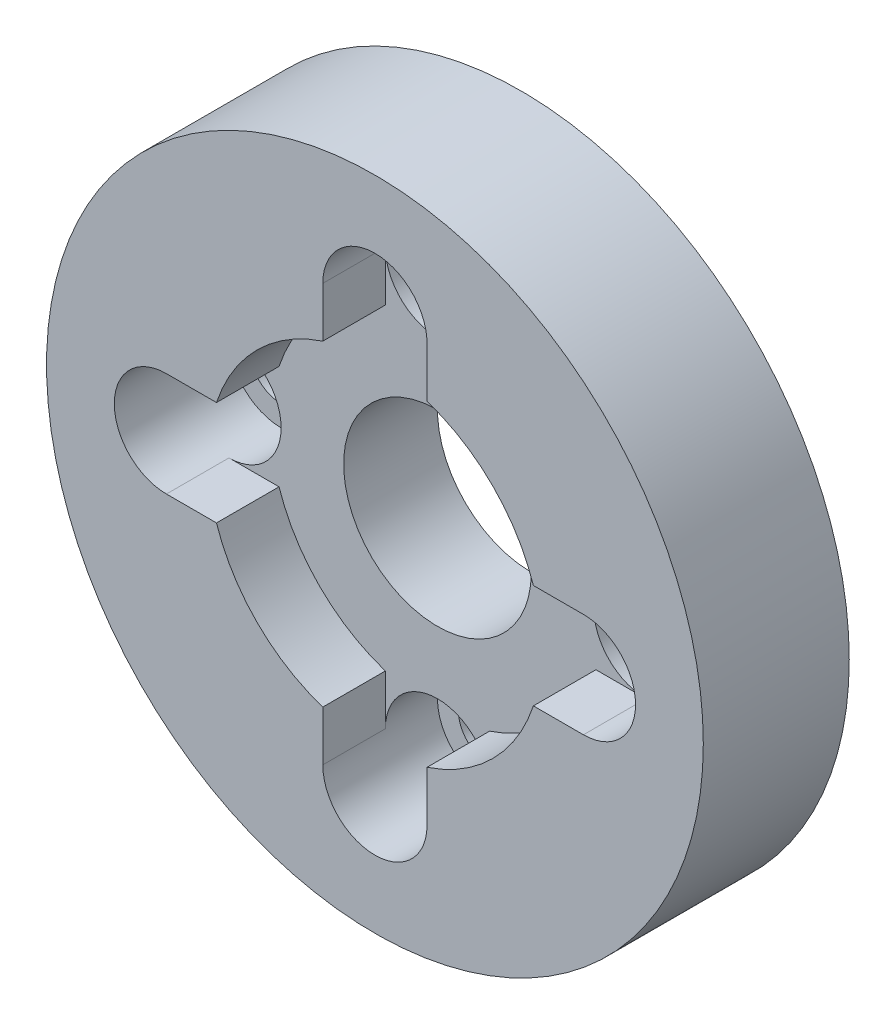
ISO-10303-21;
HEADER;
FILE_DESCRIPTION(('STEP AP214'),'2;1');
FILE_NAME('part.step','',(''),(''),'','','');
FILE_SCHEMA(('AUTOMOTIVE_DESIGN { 1 0 10303 214 1 1 1 1 }'));
ENDSEC;
DATA;
#1=APPLICATION_CONTEXT('core data for automotive mechanical design processes');
#2=APPLICATION_PROTOCOL_DEFINITION('international standard','automotive_design',2000,#1);
#3=PRODUCT_CONTEXT('',#1,'mechanical');
#4=PRODUCT('Part','Part','',(#3));
#5=PRODUCT_RELATED_PRODUCT_CATEGORY('part','',(#4));
#6=PRODUCT_DEFINITION_FORMATION('','',#4);
#7=PRODUCT_DEFINITION_CONTEXT('part definition',#1,'design');
#8=PRODUCT_DEFINITION('design','',#6,#7);
#9=PRODUCT_DEFINITION_SHAPE('','',#8);
#10=(LENGTH_UNIT() NAMED_UNIT(*) SI_UNIT(.MILLI.,.METRE.));
#11=(NAMED_UNIT(*) PLANE_ANGLE_UNIT() SI_UNIT($,.RADIAN.));
#12=(NAMED_UNIT(*) SI_UNIT($,.STERADIAN.) SOLID_ANGLE_UNIT());
#13=UNCERTAINTY_MEASURE_WITH_UNIT(LENGTH_MEASURE(1.E-05),#10,'distance_accuracy_value','');
#14=(GEOMETRIC_REPRESENTATION_CONTEXT(3) GLOBAL_UNCERTAINTY_ASSIGNED_CONTEXT((#13)) GLOBAL_UNIT_ASSIGNED_CONTEXT((#10,
#11,#12)) REPRESENTATION_CONTEXT('',''));
#15=CARTESIAN_POINT('',(0.,0.,0.));
#16=DIRECTION('',(0.,0.,1.));
#17=DIRECTION('',(1.,0.,0.));
#18=AXIS2_PLACEMENT_3D('',#15,#16,#17);
#19=CARTESIAN_POINT('',(0.,0.,14.));
#20=DIRECTION('',(0.,0.,1.));
#21=DIRECTION('',(1.,0.,0.));
#22=AXIS2_PLACEMENT_3D('',#19,#20,#21);
#23=PLANE('',#22);
#24=CARTESIAN_POINT('',(-20.,0.,14.));
#25=DIRECTION('',(0.,0.,1.));
#26=DIRECTION('',(1.,0.,0.));
#27=AXIS2_PLACEMENT_3D('',#24,#25,#26);
#28=CIRCLE('',#27,5.);
#29=CARTESIAN_POINT('',(-20.,5.,14.));
#30=VERTEX_POINT('',#29);
#31=CARTESIAN_POINT('',(-20.,-5.,14.));
#32=VERTEX_POINT('',#31);
#33=EDGE_CURVE('E358',#30,#32,#28,.T.);
#34=ORIENTED_EDGE('',*,*,#33,.F.);
#35=DIRECTION('',(1.,0.,0.));
#36=VECTOR('',#35,1.);
#37=CARTESIAN_POINT('',(0.,5.,14.));
#38=LINE('',#37,#36);
#39=CARTESIAN_POINT('',(-15.1986841535707,5.,14.));
#40=VERTEX_POINT('',#39);
#41=EDGE_CURVE('E264',#30,#40,#38,.T.);
#42=ORIENTED_EDGE('',*,*,#41,.T.);
#43=CARTESIAN_POINT('',(0.,0.,14.));
#44=DIRECTION('',(0.,0.,1.));
#45=DIRECTION('',(1.,0.,0.));
#46=AXIS2_PLACEMENT_3D('',#43,#44,#45);
#47=CIRCLE('',#46,16.);
#48=CARTESIAN_POINT('',(-5.,15.1986841535707,14.));
#49=VERTEX_POINT('',#48);
#50=EDGE_CURVE('E504',#49,#40,#47,.T.);
#51=ORIENTED_EDGE('',*,*,#50,.F.);
#52=DIRECTION('',(0.,-1.,0.));
#53=VECTOR('',#52,1.);
#54=CARTESIAN_POINT('',(-4.99999999999999,0.,14.));
#55=LINE('',#54,#53);
#56=CARTESIAN_POINT('',(-5.,20.,14.));
#57=VERTEX_POINT('',#56);
#58=EDGE_CURVE('E230',#57,#49,#55,.T.);
#59=ORIENTED_EDGE('',*,*,#58,.F.);
#60=CARTESIAN_POINT('',(0.,20.,14.));
#61=DIRECTION('',(0.,0.,1.));
#62=DIRECTION('',(1.,0.,0.));
#63=AXIS2_PLACEMENT_3D('',#60,#61,#62);
#64=CIRCLE('',#63,5.);
#65=CARTESIAN_POINT('',(5.,20.,14.));
#66=VERTEX_POINT('',#65);
#67=EDGE_CURVE('E371',#66,#57,#64,.T.);
#68=ORIENTED_EDGE('',*,*,#67,.F.);
#69=DIRECTION('',(0.,-1.,0.));
#70=VECTOR('',#69,1.);
#71=CARTESIAN_POINT('',(4.99999999999999,0.,14.));
#72=LINE('',#71,#70);
#73=CARTESIAN_POINT('',(5.,15.1986841535707,14.));
#74=VERTEX_POINT('',#73);
#75=EDGE_CURVE('E231',#66,#74,#72,.T.);
#76=ORIENTED_EDGE('',*,*,#75,.T.);
#77=CARTESIAN_POINT('',(15.1986841535707,5.,14.));
#78=VERTEX_POINT('',#77);
#79=EDGE_CURVE('E320',#78,#74,#47,.T.);
#80=ORIENTED_EDGE('',*,*,#79,.F.);
#81=DIRECTION('',(-1.,0.,0.));
#82=VECTOR('',#81,1.);
#83=CARTESIAN_POINT('',(0.,5.,14.));
#84=LINE('',#83,#82);
#85=CARTESIAN_POINT('',(20.,5.,14.));
#86=VERTEX_POINT('',#85);
#87=EDGE_CURVE('E211',#86,#78,#84,.T.);
#88=ORIENTED_EDGE('',*,*,#87,.F.);
#89=CARTESIAN_POINT('',(20.,0.,14.));
#90=DIRECTION('',(0.,0.,1.));
#91=DIRECTION('',(1.,0.,0.));
#92=AXIS2_PLACEMENT_3D('',#89,#90,#91);
#93=CIRCLE('',#92,5.);
#94=CARTESIAN_POINT('',(20.,-5.,14.));
#95=VERTEX_POINT('',#94);
#96=EDGE_CURVE('E382',#86,#95,#93,.F.);
#97=ORIENTED_EDGE('',*,*,#96,.T.);
#98=DIRECTION('',(-1.,0.,0.));
#99=VECTOR('',#98,1.);
#100=CARTESIAN_POINT('',(0.,-5.,14.));
#101=LINE('',#100,#99);
#102=CARTESIAN_POINT('',(15.1986841535707,-5.,14.));
#103=VERTEX_POINT('',#102);
#104=EDGE_CURVE('E198',#95,#103,#101,.T.);
#105=ORIENTED_EDGE('',*,*,#104,.T.);
#106=CARTESIAN_POINT('',(5.,-15.1986841535707,14.));
#107=VERTEX_POINT('',#106);
#108=EDGE_CURVE('E183',#107,#103,#47,.T.);
#109=ORIENTED_EDGE('',*,*,#108,.F.);
#110=DIRECTION('',(0.,1.,0.));
#111=VECTOR('',#110,1.);
#112=CARTESIAN_POINT('',(4.99999999999999,0.,14.));
#113=LINE('',#112,#111);
#114=CARTESIAN_POINT('',(5.,-20.,14.));
#115=VERTEX_POINT('',#114);
#116=EDGE_CURVE('E174',#115,#107,#113,.T.);
#117=ORIENTED_EDGE('',*,*,#116,.F.);
#118=CARTESIAN_POINT('',(0.,-20.,14.));
#119=DIRECTION('',(0.,0.,1.));
#120=DIRECTION('',(1.,0.,0.));
#121=AXIS2_PLACEMENT_3D('',#118,#119,#120);
#122=CIRCLE('',#121,5.);
#123=CARTESIAN_POINT('',(-5.,-20.,14.));
#124=VERTEX_POINT('',#123);
#125=EDGE_CURVE('E160',#115,#124,#122,.F.);
#126=ORIENTED_EDGE('',*,*,#125,.T.);
#127=DIRECTION('',(0.,1.,0.));
#128=VECTOR('',#127,1.);
#129=CARTESIAN_POINT('',(-4.99999999999999,0.,14.));
#130=LINE('',#129,#128);
#131=CARTESIAN_POINT('',(-5.,-15.1986841535707,14.));
#132=VERTEX_POINT('',#131);
#133=EDGE_CURVE('E246',#124,#132,#130,.T.);
#134=ORIENTED_EDGE('',*,*,#133,.T.);
#135=CARTESIAN_POINT('',(-15.1986841535707,-5.,14.));
#136=VERTEX_POINT('',#135);
#137=EDGE_CURVE('E319',#136,#132,#47,.T.);
#138=ORIENTED_EDGE('',*,*,#137,.F.);
#139=DIRECTION('',(1.,0.,0.));
#140=VECTOR('',#139,1.);
#141=CARTESIAN_POINT('',(0.,-5.,14.));
#142=LINE('',#141,#140);
#143=EDGE_CURVE('E263',#32,#136,#142,.T.);
#144=ORIENTED_EDGE('',*,*,#143,.F.);
#145=EDGE_LOOP('',(#34,#42,#51,#59,#68,#76,#80,#88,#97,#105,#109,#117,#126,#134,#138,#144));
#146=FACE_BOUND('',#145,.T.);
#147=CARTESIAN_POINT('',(0.,0.,14.));
#148=DIRECTION('',(0.,0.,1.));
#149=DIRECTION('',(1.,0.,0.));
#150=AXIS2_PLACEMENT_3D('',#147,#148,#149);
#151=CIRCLE('',#150,31.5);
#152=CARTESIAN_POINT('',(31.5,0.,14.));
#153=VERTEX_POINT('',#152);
#154=EDGE_CURVE('E321',#153,#153,#151,.T.);
#155=ORIENTED_EDGE('',*,*,#154,.T.);
#156=EDGE_LOOP('',(#155));
#157=FACE_BOUND('',#156,.T.);
#158=ADVANCED_FACE('F41',(#146,#157),#23,.T.);
#159=CARTESIAN_POINT('',(0.,0.,8.));
#160=DIRECTION('',(0.,0.,1.));
#161=DIRECTION('',(1.,0.,0.));
#162=AXIS2_PLACEMENT_3D('',#159,#160,#161);
#163=PLANE('',#162);
#164=CARTESIAN_POINT('',(-20.,0.,8.));
#165=DIRECTION('',(0.,0.,1.));
#166=DIRECTION('',(1.,0.,0.));
#167=AXIS2_PLACEMENT_3D('',#164,#165,#166);
#168=CIRCLE('',#167,5.);
#169=CARTESIAN_POINT('',(-20.,5.,8.));
#170=VERTEX_POINT('',#169);
#171=CARTESIAN_POINT('',(-20.,-5.,8.));
#172=VERTEX_POINT('',#171);
#173=EDGE_CURVE('E259',#170,#172,#168,.F.);
#174=ORIENTED_EDGE('',*,*,#173,.T.);
#175=DIRECTION('',(-1.,0.,0.));
#176=VECTOR('',#175,1.);
#177=CARTESIAN_POINT('',(0.,-5.,8.));
#178=LINE('',#177,#176);
#179=CARTESIAN_POINT('',(-15.1986841535707,-5.,8.));
#180=VERTEX_POINT('',#179);
#181=EDGE_CURVE('E68',#180,#172,#178,.T.);
#182=ORIENTED_EDGE('',*,*,#181,.F.);
#183=CARTESIAN_POINT('',(0.,0.,8.));
#184=DIRECTION('',(0.,0.,1.));
#185=DIRECTION('',(1.,0.,0.));
#186=AXIS2_PLACEMENT_3D('',#183,#184,#185);
#187=CIRCLE('',#186,16.);
#188=CARTESIAN_POINT('',(-5.,-15.1986841535707,8.));
#189=VERTEX_POINT('',#188);
#190=EDGE_CURVE('E330',#180,#189,#187,.T.);
#191=ORIENTED_EDGE('',*,*,#190,.T.);
#192=DIRECTION('',(0.,-1.,0.));
#193=VECTOR('',#192,1.);
#194=CARTESIAN_POINT('',(-4.99999999999999,0.,8.));
#195=LINE('',#194,#193);
#196=CARTESIAN_POINT('',(-5.,-20.,8.));
#197=VERTEX_POINT('',#196);
#198=EDGE_CURVE('E241',#189,#197,#195,.T.);
#199=ORIENTED_EDGE('',*,*,#198,.T.);
#200=CARTESIAN_POINT('',(0.,-20.,8.));
#201=DIRECTION('',(0.,0.,1.));
#202=DIRECTION('',(1.,0.,0.));
#203=AXIS2_PLACEMENT_3D('',#200,#201,#202);
#204=CIRCLE('',#203,5.);
#205=CARTESIAN_POINT('',(5.,-20.,8.));
#206=VERTEX_POINT('',#205);
#207=EDGE_CURVE('E236',#206,#197,#204,.T.);
#208=ORIENTED_EDGE('',*,*,#207,.F.);
#209=DIRECTION('',(0.,-1.,0.));
#210=VECTOR('',#209,1.);
#211=CARTESIAN_POINT('',(4.99999999999999,0.,8.));
#212=LINE('',#211,#210);
#213=CARTESIAN_POINT('',(5.,-15.1986841535707,8.));
#214=VERTEX_POINT('',#213);
#215=EDGE_CURVE('E175',#214,#206,#212,.T.);
#216=ORIENTED_EDGE('',*,*,#215,.F.);
#217=CARTESIAN_POINT('',(15.1986841535707,-5.,8.));
#218=VERTEX_POINT('',#217);
#219=EDGE_CURVE('E53',#214,#218,#187,.T.);
#220=ORIENTED_EDGE('',*,*,#219,.T.);
#221=DIRECTION('',(1.,0.,0.));
#222=VECTOR('',#221,1.);
#223=CARTESIAN_POINT('',(0.,-5.,8.));
#224=LINE('',#223,#222);
#225=CARTESIAN_POINT('',(20.,-5.,8.));
#226=VERTEX_POINT('',#225);
#227=EDGE_CURVE('E188',#218,#226,#224,.T.);
#228=ORIENTED_EDGE('',*,*,#227,.T.);
#229=CARTESIAN_POINT('',(20.,0.,8.));
#230=DIRECTION('',(0.,0.,1.));
#231=DIRECTION('',(1.,0.,0.));
#232=AXIS2_PLACEMENT_3D('',#229,#230,#231);
#233=CIRCLE('',#232,5.);
#234=CARTESIAN_POINT('',(20.,5.,8.));
#235=VERTEX_POINT('',#234);
#236=EDGE_CURVE('E185',#235,#226,#233,.T.);
#237=ORIENTED_EDGE('',*,*,#236,.F.);
#238=DIRECTION('',(1.,0.,0.));
#239=VECTOR('',#238,1.);
#240=CARTESIAN_POINT('',(0.,5.,8.));
#241=LINE('',#240,#239);
#242=CARTESIAN_POINT('',(15.1986841535707,5.,8.));
#243=VERTEX_POINT('',#242);
#244=EDGE_CURVE('E202',#243,#235,#241,.T.);
#245=ORIENTED_EDGE('',*,*,#244,.F.);
#246=CARTESIAN_POINT('',(5.,15.1986841535707,8.));
#247=VERTEX_POINT('',#246);
#248=EDGE_CURVE('E11',#243,#247,#187,.T.);
#249=ORIENTED_EDGE('',*,*,#248,.T.);
#250=DIRECTION('',(0.,1.,0.));
#251=VECTOR('',#250,1.);
#252=CARTESIAN_POINT('',(4.99999999999999,0.,8.));
#253=LINE('',#252,#251);
#254=CARTESIAN_POINT('',(5.,20.,8.));
#255=VERTEX_POINT('',#254);
#256=EDGE_CURVE('E222',#247,#255,#253,.T.);
#257=ORIENTED_EDGE('',*,*,#256,.T.);
#258=CARTESIAN_POINT('',(0.,20.,8.));
#259=DIRECTION('',(0.,0.,1.));
#260=DIRECTION('',(1.,0.,0.));
#261=AXIS2_PLACEMENT_3D('',#258,#259,#260);
#262=CIRCLE('',#261,5.);
#263=CARTESIAN_POINT('',(-5.,20.,8.));
#264=VERTEX_POINT('',#263);
#265=EDGE_CURVE('E226',#255,#264,#262,.F.);
#266=ORIENTED_EDGE('',*,*,#265,.T.);
#267=DIRECTION('',(0.,1.,0.));
#268=VECTOR('',#267,1.);
#269=CARTESIAN_POINT('',(-4.99999999999999,0.,8.));
#270=LINE('',#269,#268);
#271=CARTESIAN_POINT('',(-5.,15.1986841535707,8.));
#272=VERTEX_POINT('',#271);
#273=EDGE_CURVE('E269',#272,#264,#270,.T.);
#274=ORIENTED_EDGE('',*,*,#273,.F.);
#275=CARTESIAN_POINT('',(-15.1986841535707,5.,8.));
#276=VERTEX_POINT('',#275);
#277=EDGE_CURVE('E51',#272,#276,#187,.T.);
#278=ORIENTED_EDGE('',*,*,#277,.T.);
#279=DIRECTION('',(-1.,0.,0.));
#280=VECTOR('',#279,1.);
#281=CARTESIAN_POINT('',(0.,5.,8.));
#282=LINE('',#281,#280);
#283=EDGE_CURVE('E255',#276,#170,#282,.T.);
#284=ORIENTED_EDGE('',*,*,#283,.T.);
#285=EDGE_LOOP('',(#174,#182,#191,#199,#208,#216,#220,#228,#237,#245,#249,#257,#266,#274,#278,#284));
#286=FACE_BOUND('',#285,.T.);
#287=CARTESIAN_POINT('',(0.,0.,8.));
#288=DIRECTION('',(0.,0.,1.));
#289=DIRECTION('',(1.,0.,0.));
#290=AXIS2_PLACEMENT_3D('',#287,#288,#289);
#291=CIRCLE('',#290,9.);
#292=CARTESIAN_POINT('',(9.,0.,8.));
#293=VERTEX_POINT('',#292);
#294=EDGE_CURVE('E309',#293,#293,#291,.T.);
#295=ORIENTED_EDGE('',*,*,#294,.F.);
#296=EDGE_LOOP('',(#295));
#297=FACE_BOUND('',#296,.T.);
#298=ADVANCED_FACE('F402',(#286,#297),#163,.T.);
#299=CARTESIAN_POINT('',(0.,-20.,-0.999999999999999));
#300=DIRECTION('',(0.,0.,1.));
#301=DIRECTION('',(1.,0.,0.));
#302=AXIS2_PLACEMENT_3D('',#299,#300,#301);
#303=CYLINDRICAL_SURFACE('',#302,3.);
#304=CARTESIAN_POINT('',(0.,-20.,0.));
#305=DIRECTION('',(0.,0.,1.));
#306=DIRECTION('',(1.,0.,0.));
#307=AXIS2_PLACEMENT_3D('',#304,#305,#306);
#308=CIRCLE('',#307,3.);
#309=CARTESIAN_POINT('',(3.,-20.,0.));
#310=VERTEX_POINT('',#309);
#311=EDGE_CURVE('E299',#310,#310,#308,.F.);
#312=ORIENTED_EDGE('',*,*,#311,.T.);
#313=EDGE_LOOP('',(#312));
#314=FACE_BOUND('',#313,.T.);
#315=CARTESIAN_POINT('',(0.,-20.,3.));
#316=DIRECTION('',(0.,0.,1.));
#317=DIRECTION('',(1.,0.,0.));
#318=AXIS2_PLACEMENT_3D('',#315,#316,#317);
#319=CIRCLE('',#318,3.);
#320=CARTESIAN_POINT('',(3.,-20.,3.));
#321=VERTEX_POINT('',#320);
#322=EDGE_CURVE('E389',#321,#321,#319,.F.);
#323=ORIENTED_EDGE('',*,*,#322,.F.);
#324=EDGE_LOOP('',(#323));
#325=FACE_BOUND('',#324,.T.);
#326=ADVANCED_FACE('F399',(#314,#325),#303,.F.);
#327=CARTESIAN_POINT('',(20.,0.,-0.999999999999999));
#328=DIRECTION('',(0.,0.,1.));
#329=DIRECTION('',(1.,0.,0.));
#330=AXIS2_PLACEMENT_3D('',#327,#328,#329);
#331=CYLINDRICAL_SURFACE('',#330,3.);
#332=CARTESIAN_POINT('',(20.,0.,0.));
#333=DIRECTION('',(0.,0.,1.));
#334=DIRECTION('',(1.,0.,0.));
#335=AXIS2_PLACEMENT_3D('',#332,#333,#334);
#336=CIRCLE('',#335,3.);
#337=CARTESIAN_POINT('',(23.,0.,0.));
#338=VERTEX_POINT('',#337);
#339=EDGE_CURVE('E334',#338,#338,#336,.F.);
#340=ORIENTED_EDGE('',*,*,#339,.T.);
#341=EDGE_LOOP('',(#340));
#342=FACE_BOUND('',#341,.T.);
#343=CARTESIAN_POINT('',(20.,0.,3.));
#344=DIRECTION('',(0.,0.,1.));
#345=DIRECTION('',(1.,0.,0.));
#346=AXIS2_PLACEMENT_3D('',#343,#344,#345);
#347=CIRCLE('',#346,3.);
#348=CARTESIAN_POINT('',(23.,0.,3.));
#349=VERTEX_POINT('',#348);
#350=EDGE_CURVE('E377',#349,#349,#347,.F.);
#351=ORIENTED_EDGE('',*,*,#350,.F.);
#352=EDGE_LOOP('',(#351));
#353=FACE_BOUND('',#352,.T.);
#354=ADVANCED_FACE('F401',(#342,#353),#331,.F.);
#355=CARTESIAN_POINT('',(0.,20.,-0.999999999999999));
#356=DIRECTION('',(0.,0.,1.));
#357=DIRECTION('',(1.,0.,0.));
#358=AXIS2_PLACEMENT_3D('',#355,#356,#357);
#359=CYLINDRICAL_SURFACE('',#358,3.);
#360=CARTESIAN_POINT('',(0.,20.,0.));
#361=DIRECTION('',(0.,0.,1.));
#362=DIRECTION('',(1.,0.,0.));
#363=AXIS2_PLACEMENT_3D('',#360,#361,#362);
#364=CIRCLE('',#363,3.);
#365=CARTESIAN_POINT('',(3.,20.,0.));
#366=VERTEX_POINT('',#365);
#367=EDGE_CURVE('E337',#366,#366,#364,.T.);
#368=ORIENTED_EDGE('',*,*,#367,.F.);
#369=EDGE_LOOP('',(#368));
#370=FACE_BOUND('',#369,.T.);
#371=CARTESIAN_POINT('',(0.,20.,3.));
#372=DIRECTION('',(0.,0.,1.));
#373=DIRECTION('',(1.,0.,0.));
#374=AXIS2_PLACEMENT_3D('',#371,#372,#373);
#375=CIRCLE('',#374,3.);
#376=CARTESIAN_POINT('',(3.,20.,3.));
#377=VERTEX_POINT('',#376);
#378=EDGE_CURVE('E367',#377,#377,#375,.T.);
#379=ORIENTED_EDGE('',*,*,#378,.T.);
#380=EDGE_LOOP('',(#379));
#381=FACE_BOUND('',#380,.T.);
#382=ADVANCED_FACE('F351',(#370,#381),#359,.F.);
#383=CARTESIAN_POINT('',(-20.,0.,-0.999999999999999));
#384=DIRECTION('',(0.,0.,1.));
#385=DIRECTION('',(1.,0.,0.));
#386=AXIS2_PLACEMENT_3D('',#383,#384,#385);
#387=CYLINDRICAL_SURFACE('',#386,3.);
#388=CARTESIAN_POINT('',(-20.,0.,0.));
#389=DIRECTION('',(0.,0.,1.));
#390=DIRECTION('',(1.,0.,0.));
#391=AXIS2_PLACEMENT_3D('',#388,#389,#390);
#392=CIRCLE('',#391,3.);
#393=CARTESIAN_POINT('',(-17.,0.,0.));
#394=VERTEX_POINT('',#393);
#395=EDGE_CURVE('E45',#394,#394,#392,.T.);
#396=ORIENTED_EDGE('',*,*,#395,.F.);
#397=EDGE_LOOP('',(#396));
#398=FACE_BOUND('',#397,.T.);
#399=CARTESIAN_POINT('',(-20.,0.,3.));
#400=DIRECTION('',(0.,0.,1.));
#401=DIRECTION('',(1.,0.,0.));
#402=AXIS2_PLACEMENT_3D('',#399,#400,#401);
#403=CIRCLE('',#402,3.);
#404=CARTESIAN_POINT('',(-17.,0.,3.));
#405=VERTEX_POINT('',#404);
#406=EDGE_CURVE('E355',#405,#405,#403,.T.);
#407=ORIENTED_EDGE('',*,*,#406,.T.);
#408=EDGE_LOOP('',(#407));
#409=FACE_BOUND('',#408,.T.);
#410=ADVANCED_FACE('F348',(#398,#409),#387,.F.);
#411=CARTESIAN_POINT('',(0.,0.,14.));
#412=DIRECTION('',(0.,0.,-1.));
#413=DIRECTION('',(-1.,0.,0.));
#414=AXIS2_PLACEMENT_3D('',#411,#412,#413);
#415=CYLINDRICAL_SURFACE('',#414,16.);
#416=ORIENTED_EDGE('',*,*,#137,.T.);
#417=DIRECTION('',(0.,0.,1.));
#418=VECTOR('',#417,1.);
#419=CARTESIAN_POINT('',(-5.,-15.1986841535707,2.66486235864437));
#420=LINE('',#419,#418);
#421=EDGE_CURVE('E245',#189,#132,#420,.T.);
#422=ORIENTED_EDGE('',*,*,#421,.F.);
#423=ORIENTED_EDGE('',*,*,#190,.F.);
#424=DIRECTION('',(0.,0.,1.));
#425=VECTOR('',#424,1.);
#426=CARTESIAN_POINT('',(-15.1986841535707,-5.,2.66486235864437));
#427=LINE('',#426,#425);
#428=EDGE_CURVE('E290',#180,#136,#427,.T.);
#429=ORIENTED_EDGE('',*,*,#428,.T.);
#430=EDGE_LOOP('',(#416,#422,#423,#429));
#431=FACE_BOUND('',#430,.T.);
#432=ADVANCED_FACE('F43',(#431),#415,.F.);
#433=ORIENTED_EDGE('',*,*,#79,.T.);
#434=DIRECTION('',(0.,0.,1.));
#435=VECTOR('',#434,1.);
#436=CARTESIAN_POINT('',(5.,15.1986841535707,2.66486235864437));
#437=LINE('',#436,#435);
#438=EDGE_CURVE('E235',#247,#74,#437,.T.);
#439=ORIENTED_EDGE('',*,*,#438,.F.);
#440=ORIENTED_EDGE('',*,*,#248,.F.);
#441=DIRECTION('',(0.,0.,1.));
#442=VECTOR('',#441,1.);
#443=CARTESIAN_POINT('',(15.1986841535707,5.,2.66486235864437));
#444=LINE('',#443,#442);
#445=EDGE_CURVE('E210',#243,#78,#444,.T.);
#446=ORIENTED_EDGE('',*,*,#445,.T.);
#447=EDGE_LOOP('',(#433,#439,#440,#446));
#448=FACE_BOUND('',#447,.T.);
#449=ADVANCED_FACE('F522',(#448),#415,.F.);
#450=DIRECTION('',(0.,0.,1.));
#451=VECTOR('',#450,1.);
#452=CARTESIAN_POINT('',(-5.,15.1986841535707,2.66486235864437));
#453=LINE('',#452,#451);
#454=EDGE_CURVE('E277',#272,#49,#453,.T.);
#455=ORIENTED_EDGE('',*,*,#454,.T.);
#456=ORIENTED_EDGE('',*,*,#50,.T.);
#457=DIRECTION('',(0.,0.,1.));
#458=VECTOR('',#457,1.);
#459=CARTESIAN_POINT('',(-15.1986841535707,5.,2.66486235864437));
#460=LINE('',#459,#458);
#461=EDGE_CURVE('E268',#276,#40,#460,.T.);
#462=ORIENTED_EDGE('',*,*,#461,.F.);
#463=ORIENTED_EDGE('',*,*,#277,.F.);
#464=EDGE_LOOP('',(#455,#456,#462,#463));
#465=FACE_BOUND('',#464,.T.);
#466=ADVANCED_FACE('F506',(#465),#415,.F.);
#467=DIRECTION('',(0.,0.,1.));
#468=VECTOR('',#467,1.);
#469=CARTESIAN_POINT('',(5.,-15.1986841535707,2.66486235864437));
#470=LINE('',#469,#468);
#471=EDGE_CURVE('E60',#214,#107,#470,.T.);
#472=ORIENTED_EDGE('',*,*,#471,.T.);
#473=ORIENTED_EDGE('',*,*,#108,.T.);
#474=DIRECTION('',(0.,0.,1.));
#475=VECTOR('',#474,1.);
#476=CARTESIAN_POINT('',(15.1986841535707,-5.,2.66486235864437));
#477=LINE('',#476,#475);
#478=EDGE_CURVE('E197',#218,#103,#477,.T.);
#479=ORIENTED_EDGE('',*,*,#478,.F.);
#480=ORIENTED_EDGE('',*,*,#219,.F.);
#481=EDGE_LOOP('',(#472,#473,#479,#480));
#482=FACE_BOUND('',#481,.T.);
#483=ADVANCED_FACE('F422',(#482),#415,.F.);
#484=CARTESIAN_POINT('',(0.,0.,0.));
#485=DIRECTION('',(0.,0.,1.));
#486=DIRECTION('',(1.,0.,0.));
#487=AXIS2_PLACEMENT_3D('',#484,#485,#486);
#488=PLANE('',#487);
#489=ORIENTED_EDGE('',*,*,#367,.T.);
#490=EDGE_LOOP('',(#489));
#491=FACE_BOUND('',#490,.T.);
#492=ORIENTED_EDGE('',*,*,#339,.F.);
#493=EDGE_LOOP('',(#492));
#494=FACE_BOUND('',#493,.T.);
#495=ORIENTED_EDGE('',*,*,#311,.F.);
#496=EDGE_LOOP('',(#495));
#497=FACE_BOUND('',#496,.T.);
#498=CARTESIAN_POINT('',(0.,0.,0.));
#499=DIRECTION('',(0.,0.,1.));
#500=DIRECTION('',(1.,0.,0.));
#501=AXIS2_PLACEMENT_3D('',#498,#499,#500);
#502=CIRCLE('',#501,12.5);
#503=CARTESIAN_POINT('',(12.5,0.,0.));
#504=VERTEX_POINT('',#503);
#505=EDGE_CURVE('E305',#504,#504,#502,.T.);
#506=ORIENTED_EDGE('',*,*,#505,.T.);
#507=EDGE_LOOP('',(#506));
#508=FACE_BOUND('',#507,.T.);
#509=CARTESIAN_POINT('',(0.,0.,0.));
#510=DIRECTION('',(0.,0.,1.));
#511=DIRECTION('',(1.,0.,0.));
#512=AXIS2_PLACEMENT_3D('',#509,#510,#511);
#513=CIRCLE('',#512,31.5);
#514=CARTESIAN_POINT('',(31.5,0.,0.));
#515=VERTEX_POINT('',#514);
#516=EDGE_CURVE('E316',#515,#515,#513,.T.);
#517=ORIENTED_EDGE('',*,*,#516,.F.);
#518=EDGE_LOOP('',(#517));
#519=FACE_BOUND('',#518,.T.);
#520=ORIENTED_EDGE('',*,*,#395,.T.);
#521=EDGE_LOOP('',(#520));
#522=FACE_BOUND('',#521,.T.);
#523=ADVANCED_FACE('F346',(#491,#494,#497,#508,#519,#522),#488,.F.);
#524=CARTESIAN_POINT('',(0.,0.,14.));
#525=DIRECTION('',(0.,0.,-1.));
#526=DIRECTION('',(-1.,0.,0.));
#527=AXIS2_PLACEMENT_3D('',#524,#525,#526);
#528=CYLINDRICAL_SURFACE('',#527,31.5);
#529=ORIENTED_EDGE('',*,*,#154,.F.);
#530=EDGE_LOOP('',(#529));
#531=FACE_BOUND('',#530,.T.);
#532=ORIENTED_EDGE('',*,*,#516,.T.);
#533=EDGE_LOOP('',(#532));
#534=FACE_BOUND('',#533,.T.);
#535=ADVANCED_FACE('F421',(#531,#534),#528,.T.);
#536=CARTESIAN_POINT('',(0.,0.,8.));
#537=DIRECTION('',(0.,0.,-1.));
#538=DIRECTION('',(-1.,0.,0.));
#539=AXIS2_PLACEMENT_3D('',#536,#537,#538);
#540=CYLINDRICAL_SURFACE('',#539,9.);
#541=ORIENTED_EDGE('',*,*,#294,.T.);
#542=EDGE_LOOP('',(#541));
#543=FACE_BOUND('',#542,.T.);
#544=CARTESIAN_POINT('',(0.,0.,-1.));
#545=DIRECTION('',(0.,0.,1.));
#546=DIRECTION('',(1.,0.,0.));
#547=AXIS2_PLACEMENT_3D('',#544,#545,#546);
#548=CIRCLE('',#547,9.);
#549=CARTESIAN_POINT('',(9.,0.,-1.));
#550=VERTEX_POINT('',#549);
#551=EDGE_CURVE('E300',#550,#550,#548,.T.);
#552=ORIENTED_EDGE('',*,*,#551,.F.);
#553=EDGE_LOOP('',(#552));
#554=FACE_BOUND('',#553,.T.);
#555=ADVANCED_FACE('F419',(#543,#554),#540,.F.);
#556=CARTESIAN_POINT('',(0.,0.,-1.));
#557=DIRECTION('',(0.,0.,1.));
#558=DIRECTION('',(1.,0.,0.));
#559=AXIS2_PLACEMENT_3D('',#556,#557,#558);
#560=CYLINDRICAL_SURFACE('',#559,12.5);
#561=CARTESIAN_POINT('',(0.,0.,-1.));
#562=DIRECTION('',(0.,0.,1.));
#563=DIRECTION('',(1.,0.,0.));
#564=AXIS2_PLACEMENT_3D('',#561,#562,#563);
#565=CIRCLE('',#564,12.5);
#566=CARTESIAN_POINT('',(12.5,0.,-1.));
#567=VERTEX_POINT('',#566);
#568=EDGE_CURVE('E304',#567,#567,#565,.T.);
#569=ORIENTED_EDGE('',*,*,#568,.T.);
#570=EDGE_LOOP('',(#569));
#571=FACE_BOUND('',#570,.T.);
#572=ORIENTED_EDGE('',*,*,#505,.F.);
#573=EDGE_LOOP('',(#572));
#574=FACE_BOUND('',#573,.T.);
#575=ADVANCED_FACE('F428',(#571,#574),#560,.T.);
#576=CARTESIAN_POINT('',(0.,0.,-1.));
#577=DIRECTION('',(0.,0.,1.));
#578=DIRECTION('',(1.,0.,0.));
#579=AXIS2_PLACEMENT_3D('',#576,#577,#578);
#580=PLANE('',#579);
#581=ORIENTED_EDGE('',*,*,#551,.T.);
#582=EDGE_LOOP('',(#581));
#583=FACE_BOUND('',#582,.T.);
#584=ORIENTED_EDGE('',*,*,#568,.F.);
#585=EDGE_LOOP('',(#584));
#586=FACE_BOUND('',#585,.T.);
#587=ADVANCED_FACE('F437',(#583,#586),#580,.F.);
#588=CARTESIAN_POINT('',(0.,-5.,2.66486235864437));
#589=DIRECTION('',(0.,-1.,0.));
#590=DIRECTION('',(0.,0.,-1.));
#591=AXIS2_PLACEMENT_3D('',#588,#589,#590);
#592=PLANE('',#591);
#593=ORIENTED_EDGE('',*,*,#181,.T.);
#594=DIRECTION('',(0.,0.,1.));
#595=VECTOR('',#594,1.);
#596=CARTESIAN_POINT('',(-20.,-5.,2.66486235864437));
#597=LINE('',#596,#595);
#598=EDGE_CURVE('E289',#172,#32,#597,.T.);
#599=ORIENTED_EDGE('',*,*,#598,.T.);
#600=ORIENTED_EDGE('',*,*,#143,.T.);
#601=ORIENTED_EDGE('',*,*,#428,.F.);
#602=EDGE_LOOP('',(#593,#599,#600,#601));
#603=FACE_BOUND('',#602,.T.);
#604=ADVANCED_FACE('F446',(#603),#592,.F.);
#605=CARTESIAN_POINT('',(0.,5.,2.66486235864437));
#606=DIRECTION('',(0.,1.,0.));
#607=DIRECTION('',(0.,0.,1.));
#608=AXIS2_PLACEMENT_3D('',#605,#606,#607);
#609=PLANE('',#608);
#610=ORIENTED_EDGE('',*,*,#244,.T.);
#611=DIRECTION('',(0.,0.,1.));
#612=VECTOR('',#611,1.);
#613=CARTESIAN_POINT('',(20.,5.,2.66486235864437));
#614=LINE('',#613,#612);
#615=EDGE_CURVE('E214',#235,#86,#614,.T.);
#616=ORIENTED_EDGE('',*,*,#615,.T.);
#617=ORIENTED_EDGE('',*,*,#87,.T.);
#618=ORIENTED_EDGE('',*,*,#445,.F.);
#619=EDGE_LOOP('',(#610,#616,#617,#618));
#620=FACE_BOUND('',#619,.T.);
#621=ADVANCED_FACE('F454',(#620),#609,.F.);
#622=CARTESIAN_POINT('',(0.,-5.,2.66486235864437));
#623=DIRECTION('',(0.,1.,0.));
#624=DIRECTION('',(0.,0.,1.));
#625=AXIS2_PLACEMENT_3D('',#622,#623,#624);
#626=PLANE('',#625);
#627=ORIENTED_EDGE('',*,*,#478,.T.);
#628=ORIENTED_EDGE('',*,*,#104,.F.);
#629=DIRECTION('',(0.,0.,1.));
#630=VECTOR('',#629,1.);
#631=CARTESIAN_POINT('',(20.,-5.,2.66486235864437));
#632=LINE('',#631,#630);
#633=EDGE_CURVE('E201',#226,#95,#632,.T.);
#634=ORIENTED_EDGE('',*,*,#633,.F.);
#635=ORIENTED_EDGE('',*,*,#227,.F.);
#636=EDGE_LOOP('',(#627,#628,#634,#635));
#637=FACE_BOUND('',#636,.T.);
#638=ADVANCED_FACE('F460',(#637),#626,.T.);
#639=CARTESIAN_POINT('',(4.99999999999999,0.,2.66486235864437));
#640=DIRECTION('',(1.,0.,0.));
#641=DIRECTION('',(0.,1.,0.));
#642=AXIS2_PLACEMENT_3D('',#639,#640,#641);
#643=PLANE('',#642);
#644=ORIENTED_EDGE('',*,*,#215,.T.);
#645=DIRECTION('',(0.,0.,1.));
#646=VECTOR('',#645,1.);
#647=CARTESIAN_POINT('',(5.,-20.,2.66486235864437));
#648=LINE('',#647,#646);
#649=EDGE_CURVE('E163',#206,#115,#648,.T.);
#650=ORIENTED_EDGE('',*,*,#649,.T.);
#651=ORIENTED_EDGE('',*,*,#116,.T.);
#652=ORIENTED_EDGE('',*,*,#471,.F.);
#653=EDGE_LOOP('',(#644,#650,#651,#652));
#654=FACE_BOUND('',#653,.T.);
#655=ADVANCED_FACE('F173',(#654),#643,.F.);
#656=CARTESIAN_POINT('',(0.,5.,2.66486235864437));
#657=DIRECTION('',(0.,-1.,0.));
#658=DIRECTION('',(0.,0.,-1.));
#659=AXIS2_PLACEMENT_3D('',#656,#657,#658);
#660=PLANE('',#659);
#661=ORIENTED_EDGE('',*,*,#461,.T.);
#662=ORIENTED_EDGE('',*,*,#41,.F.);
#663=DIRECTION('',(0.,0.,1.));
#664=VECTOR('',#663,1.);
#665=CARTESIAN_POINT('',(-20.,5.,2.66486235864437));
#666=LINE('',#665,#664);
#667=EDGE_CURVE('E260',#170,#30,#666,.T.);
#668=ORIENTED_EDGE('',*,*,#667,.F.);
#669=ORIENTED_EDGE('',*,*,#283,.F.);
#670=EDGE_LOOP('',(#661,#662,#668,#669));
#671=FACE_BOUND('',#670,.T.);
#672=ADVANCED_FACE('F617',(#671),#660,.T.);
#673=CARTESIAN_POINT('',(-4.99999999999999,0.,2.66486235864437));
#674=DIRECTION('',(-1.,0.,0.));
#675=DIRECTION('',(0.,-1.,0.));
#676=AXIS2_PLACEMENT_3D('',#673,#674,#675);
#677=PLANE('',#676);
#678=ORIENTED_EDGE('',*,*,#273,.T.);
#679=DIRECTION('',(0.,0.,1.));
#680=VECTOR('',#679,1.);
#681=CARTESIAN_POINT('',(-5.,20.,2.66486235864437));
#682=LINE('',#681,#680);
#683=EDGE_CURVE('E276',#264,#57,#682,.T.);
#684=ORIENTED_EDGE('',*,*,#683,.T.);
#685=ORIENTED_EDGE('',*,*,#58,.T.);
#686=ORIENTED_EDGE('',*,*,#454,.F.);
#687=EDGE_LOOP('',(#678,#684,#685,#686));
#688=FACE_BOUND('',#687,.T.);
#689=ADVANCED_FACE('F464',(#688),#677,.F.);
#690=CARTESIAN_POINT('',(4.99999999999999,0.,2.66486235864437));
#691=DIRECTION('',(-1.,0.,0.));
#692=DIRECTION('',(0.,-1.,0.));
#693=AXIS2_PLACEMENT_3D('',#690,#691,#692);
#694=PLANE('',#693);
#695=ORIENTED_EDGE('',*,*,#438,.T.);
#696=ORIENTED_EDGE('',*,*,#75,.F.);
#697=DIRECTION('',(0.,0.,1.));
#698=VECTOR('',#697,1.);
#699=CARTESIAN_POINT('',(5.,20.,2.66486235864437));
#700=LINE('',#699,#698);
#701=EDGE_CURVE('E227',#255,#66,#700,.T.);
#702=ORIENTED_EDGE('',*,*,#701,.F.);
#703=ORIENTED_EDGE('',*,*,#256,.F.);
#704=EDGE_LOOP('',(#695,#696,#702,#703));
#705=FACE_BOUND('',#704,.T.);
#706=ADVANCED_FACE('F499',(#705),#694,.T.);
#707=CARTESIAN_POINT('',(-4.99999999999999,0.,2.66486235864437));
#708=DIRECTION('',(1.,0.,0.));
#709=DIRECTION('',(0.,1.,0.));
#710=AXIS2_PLACEMENT_3D('',#707,#708,#709);
#711=PLANE('',#710);
#712=ORIENTED_EDGE('',*,*,#421,.T.);
#713=ORIENTED_EDGE('',*,*,#133,.F.);
#714=DIRECTION('',(0.,0.,1.));
#715=VECTOR('',#714,1.);
#716=CARTESIAN_POINT('',(-5.,-20.,2.66486235864437));
#717=LINE('',#716,#715);
#718=EDGE_CURVE('E165',#197,#124,#717,.T.);
#719=ORIENTED_EDGE('',*,*,#718,.F.);
#720=ORIENTED_EDGE('',*,*,#198,.F.);
#721=EDGE_LOOP('',(#712,#713,#719,#720));
#722=FACE_BOUND('',#721,.T.);
#723=ADVANCED_FACE('F516',(#722),#711,.T.);
#724=CARTESIAN_POINT('',(0.,-20.,3.));
#725=DIRECTION('',(0.,0.,1.));
#726=DIRECTION('',(1.,0.,0.));
#727=AXIS2_PLACEMENT_3D('',#724,#725,#726);
#728=CYLINDRICAL_SURFACE('',#727,5.);
#729=CARTESIAN_POINT('',(0.,-20.,3.));
#730=DIRECTION('',(0.,0.,1.));
#731=DIRECTION('',(1.,0.,0.));
#732=AXIS2_PLACEMENT_3D('',#729,#730,#731);
#733=CIRCLE('',#732,5.);
#734=CARTESIAN_POINT('',(5.,-20.,3.));
#735=VERTEX_POINT('',#734);
#736=EDGE_CURVE('E171',#735,#735,#733,.F.);
#737=ORIENTED_EDGE('',*,*,#736,.T.);
#738=EDGE_LOOP('',(#737));
#739=FACE_BOUND('',#738,.T.);
#740=ORIENTED_EDGE('',*,*,#207,.T.);
#741=ORIENTED_EDGE('',*,*,#718,.T.);
#742=ORIENTED_EDGE('',*,*,#125,.F.);
#743=ORIENTED_EDGE('',*,*,#649,.F.);
#744=EDGE_LOOP('',(#740,#741,#742,#743));
#745=FACE_BOUND('',#744,.T.);
#746=ADVANCED_FACE('F162',(#739,#745),#728,.F.);
#747=CARTESIAN_POINT('',(0.,0.,3.));
#748=DIRECTION('',(0.,0.,1.));
#749=DIRECTION('',(1.,0.,0.));
#750=AXIS2_PLACEMENT_3D('',#747,#748,#749);
#751=PLANE('',#750);
#752=ORIENTED_EDGE('',*,*,#736,.F.);
#753=EDGE_LOOP('',(#752));
#754=FACE_BOUND('',#753,.T.);
#755=ORIENTED_EDGE('',*,*,#322,.T.);
#756=EDGE_LOOP('',(#755));
#757=FACE_BOUND('',#756,.T.);
#758=ADVANCED_FACE('F397',(#754,#757),#751,.T.);
#759=CARTESIAN_POINT('',(0.,20.,3.));
#760=DIRECTION('',(0.,0.,1.));
#761=DIRECTION('',(1.,0.,0.));
#762=AXIS2_PLACEMENT_3D('',#759,#760,#761);
#763=CYLINDRICAL_SURFACE('',#762,5.);
#764=CARTESIAN_POINT('',(0.,20.,3.));
#765=DIRECTION('',(0.,0.,1.));
#766=DIRECTION('',(1.,0.,0.));
#767=AXIS2_PLACEMENT_3D('',#764,#765,#766);
#768=CIRCLE('',#767,5.);
#769=CARTESIAN_POINT('',(5.,20.,3.));
#770=VERTEX_POINT('',#769);
#771=EDGE_CURVE('E364',#770,#770,#768,.T.);
#772=ORIENTED_EDGE('',*,*,#771,.F.);
#773=EDGE_LOOP('',(#772));
#774=FACE_BOUND('',#773,.T.);
#775=ORIENTED_EDGE('',*,*,#683,.F.);
#776=ORIENTED_EDGE('',*,*,#265,.F.);
#777=ORIENTED_EDGE('',*,*,#701,.T.);
#778=ORIENTED_EDGE('',*,*,#67,.T.);
#779=EDGE_LOOP('',(#775,#776,#777,#778));
#780=FACE_BOUND('',#779,.T.);
#781=ADVANCED_FACE('F478',(#774,#780),#763,.F.);
#782=CARTESIAN_POINT('',(0.,0.,3.));
#783=DIRECTION('',(0.,0.,1.));
#784=DIRECTION('',(1.,0.,0.));
#785=AXIS2_PLACEMENT_3D('',#782,#783,#784);
#786=PLANE('',#785);
#787=ORIENTED_EDGE('',*,*,#378,.F.);
#788=EDGE_LOOP('',(#787));
#789=FACE_BOUND('',#788,.T.);
#790=ORIENTED_EDGE('',*,*,#771,.T.);
#791=EDGE_LOOP('',(#790));
#792=FACE_BOUND('',#791,.T.);
#793=ADVANCED_FACE('F474',(#789,#792),#786,.T.);
#794=CARTESIAN_POINT('',(-20.,0.,3.));
#795=DIRECTION('',(0.,0.,1.));
#796=DIRECTION('',(1.,0.,0.));
#797=AXIS2_PLACEMENT_3D('',#794,#795,#796);
#798=CYLINDRICAL_SURFACE('',#797,5.);
#799=ORIENTED_EDGE('',*,*,#598,.F.);
#800=ORIENTED_EDGE('',*,*,#173,.F.);
#801=ORIENTED_EDGE('',*,*,#667,.T.);
#802=ORIENTED_EDGE('',*,*,#33,.T.);
#803=EDGE_LOOP('',(#799,#800,#801,#802));
#804=FACE_BOUND('',#803,.T.);
#805=CARTESIAN_POINT('',(-20.,0.,3.));
#806=DIRECTION('',(0.,0.,1.));
#807=DIRECTION('',(1.,0.,0.));
#808=AXIS2_PLACEMENT_3D('',#805,#806,#807);
#809=CIRCLE('',#808,5.);
#810=CARTESIAN_POINT('',(-15.,0.,3.));
#811=VERTEX_POINT('',#810);
#812=EDGE_CURVE('E215',#811,#811,#809,.T.);
#813=ORIENTED_EDGE('',*,*,#812,.F.);
#814=EDGE_LOOP('',(#813));
#815=FACE_BOUND('',#814,.T.);
#816=ADVANCED_FACE('F477',(#804,#815),#798,.F.);
#817=CARTESIAN_POINT('',(0.,0.,3.));
#818=DIRECTION('',(0.,0.,1.));
#819=DIRECTION('',(1.,0.,0.));
#820=AXIS2_PLACEMENT_3D('',#817,#818,#819);
#821=PLANE('',#820);
#822=ORIENTED_EDGE('',*,*,#406,.F.);
#823=EDGE_LOOP('',(#822));
#824=FACE_BOUND('',#823,.T.);
#825=ORIENTED_EDGE('',*,*,#812,.T.);
#826=EDGE_LOOP('',(#825));
#827=FACE_BOUND('',#826,.T.);
#828=ADVANCED_FACE('F687',(#824,#827),#821,.T.);
#829=CARTESIAN_POINT('',(20.,0.,3.));
#830=DIRECTION('',(0.,0.,1.));
#831=DIRECTION('',(1.,0.,0.));
#832=AXIS2_PLACEMENT_3D('',#829,#830,#831);
#833=CYLINDRICAL_SURFACE('',#832,5.);
#834=CARTESIAN_POINT('',(20.,0.,3.));
#835=DIRECTION('',(0.,0.,1.));
#836=DIRECTION('',(1.,0.,0.));
#837=AXIS2_PLACEMENT_3D('',#834,#835,#836);
#838=CIRCLE('',#837,5.);
#839=CARTESIAN_POINT('',(25.,0.,3.));
#840=VERTEX_POINT('',#839);
#841=EDGE_CURVE('E378',#840,#840,#838,.F.);
#842=ORIENTED_EDGE('',*,*,#841,.T.);
#843=EDGE_LOOP('',(#842));
#844=FACE_BOUND('',#843,.T.);
#845=ORIENTED_EDGE('',*,*,#236,.T.);
#846=ORIENTED_EDGE('',*,*,#633,.T.);
#847=ORIENTED_EDGE('',*,*,#96,.F.);
#848=ORIENTED_EDGE('',*,*,#615,.F.);
#849=EDGE_LOOP('',(#845,#846,#847,#848));
#850=FACE_BOUND('',#849,.T.);
#851=ADVANCED_FACE('F527',(#844,#850),#833,.F.);
#852=CARTESIAN_POINT('',(0.,0.,3.));
#853=DIRECTION('',(0.,0.,1.));
#854=DIRECTION('',(1.,0.,0.));
#855=AXIS2_PLACEMENT_3D('',#852,#853,#854);
#856=PLANE('',#855);
#857=ORIENTED_EDGE('',*,*,#841,.F.);
#858=EDGE_LOOP('',(#857));
#859=FACE_BOUND('',#858,.T.);
#860=ORIENTED_EDGE('',*,*,#350,.T.);
#861=EDGE_LOOP('',(#860));
#862=FACE_BOUND('',#861,.T.);
#863=ADVANCED_FACE('F707',(#859,#862),#856,.T.);
#864=CLOSED_SHELL('',(#158,#298,#326,#354,#382,#410,#432,#449,#466,#483,#523,#535,#555,#575,
#587,#604,#621,#638,#655,#672,#689,#706,#723,#746,#758,#781,#793,#816,#828,#851,#863));
#865=MANIFOLD_SOLID_BREP('B2',#864);
#866=ADVANCED_BREP_SHAPE_REPRESENTATION('',(#18,#865),#14);
#867=SHAPE_DEFINITION_REPRESENTATION(#9,#866);
ENDSEC;
END-ISO-10303-21;
